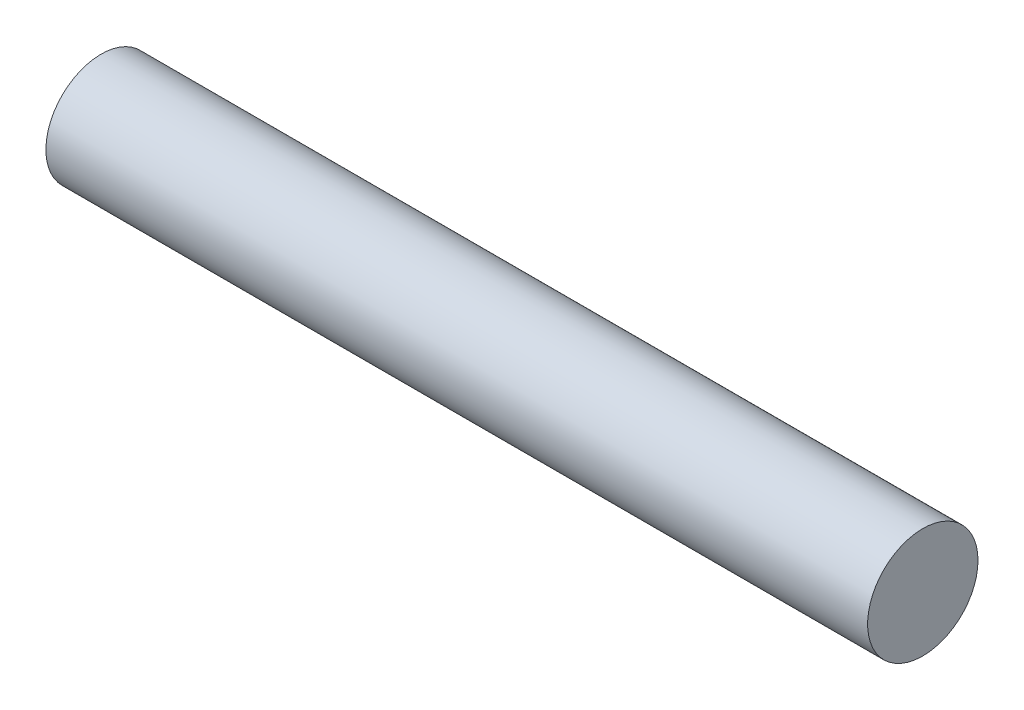
ISO-10303-21;
HEADER;
FILE_DESCRIPTION(('STEP AP214'),'2;1');
FILE_NAME('part.step','',(''),(''),'','','');
FILE_SCHEMA(('AUTOMOTIVE_DESIGN { 1 0 10303 214 1 1 1 1 }'));
ENDSEC;
DATA;
#1=APPLICATION_CONTEXT('core data for automotive mechanical design processes');
#2=APPLICATION_PROTOCOL_DEFINITION('international standard','automotive_design',2000,#1);
#3=PRODUCT_CONTEXT('',#1,'mechanical');
#4=PRODUCT('Part','Part','',(#3));
#5=PRODUCT_RELATED_PRODUCT_CATEGORY('part','',(#4));
#6=PRODUCT_DEFINITION_FORMATION('','',#4);
#7=PRODUCT_DEFINITION_CONTEXT('part definition',#1,'design');
#8=PRODUCT_DEFINITION('design','',#6,#7);
#9=PRODUCT_DEFINITION_SHAPE('','',#8);
#10=(LENGTH_UNIT() NAMED_UNIT(*) SI_UNIT(.MILLI.,.METRE.));
#11=(NAMED_UNIT(*) PLANE_ANGLE_UNIT() SI_UNIT($,.RADIAN.));
#12=(NAMED_UNIT(*) SI_UNIT($,.STERADIAN.) SOLID_ANGLE_UNIT());
#13=UNCERTAINTY_MEASURE_WITH_UNIT(LENGTH_MEASURE(1.E-05),#10,'distance_accuracy_value','');
#14=(GEOMETRIC_REPRESENTATION_CONTEXT(3) GLOBAL_UNCERTAINTY_ASSIGNED_CONTEXT((#13)) GLOBAL_UNIT_ASSIGNED_CONTEXT((#10,
#11,#12)) REPRESENTATION_CONTEXT('',''));
#15=CARTESIAN_POINT('',(0.,0.,0.));
#16=DIRECTION('',(0.,0.,1.));
#17=DIRECTION('',(1.,0.,0.));
#18=AXIS2_PLACEMENT_3D('',#15,#16,#17);
#19=CARTESIAN_POINT('',(65.2355122421383,0.,0.));
#20=DIRECTION('',(-1.,0.,0.));
#21=DIRECTION('',(0.,0.,1.));
#22=AXIS2_PLACEMENT_3D('',#19,#20,#21);
#23=CYLINDRICAL_SURFACE('',#22,6.34999999999999);
#24=CARTESIAN_POINT('',(-45.6875,0.,0.));
#25=DIRECTION('',(1.,0.,0.));
#26=DIRECTION('',(0.,0.,-1.));
#27=AXIS2_PLACEMENT_3D('',#24,#25,#26);
#28=CIRCLE('',#27,6.34999999999999);
#29=CARTESIAN_POINT('',(-45.6875,0.,-6.34999999999999));
#30=VERTEX_POINT('',#29);
#31=EDGE_CURVE('E10',#30,#30,#28,.F.);
#32=ORIENTED_EDGE('',*,*,#31,.F.);
#33=EDGE_LOOP('',(#32));
#34=FACE_BOUND('',#33,.T.);
#35=CARTESIAN_POINT('',(48.8624999999999,0.,0.));
#36=DIRECTION('',(1.,0.,0.));
#37=DIRECTION('',(0.,0.,-1.));
#38=AXIS2_PLACEMENT_3D('',#35,#36,#37);
#39=CIRCLE('',#38,6.35);
#40=CARTESIAN_POINT('',(48.8624999999999,0.,-6.35));
#41=VERTEX_POINT('',#40);
#42=EDGE_CURVE('E42',#41,#41,#39,.T.);
#43=ORIENTED_EDGE('',*,*,#42,.F.);
#44=EDGE_LOOP('',(#43));
#45=FACE_BOUND('',#44,.T.);
#46=ADVANCED_FACE('F35',(#34,#45),#23,.T.);
#47=CARTESIAN_POINT('',(-45.6875,6.35,0.));
#48=DIRECTION('',(1.,0.,0.));
#49=DIRECTION('',(0.,1.,0.));
#50=AXIS2_PLACEMENT_3D('',#47,#48,#49);
#51=PLANE('',#50);
#52=ORIENTED_EDGE('',*,*,#31,.T.);
#53=EDGE_LOOP('',(#52));
#54=FACE_BOUND('',#53,.T.);
#55=ADVANCED_FACE('F54',(#54),#51,.F.);
#56=CARTESIAN_POINT('',(48.8624999999999,0.,0.));
#57=DIRECTION('',(1.,0.,0.));
#58=DIRECTION('',(0.,0.,-1.));
#59=AXIS2_PLACEMENT_3D('',#56,#57,#58);
#60=PLANE('',#59);
#61=ORIENTED_EDGE('',*,*,#42,.T.);
#62=EDGE_LOOP('',(#61));
#63=FACE_BOUND('',#62,.T.);
#64=ADVANCED_FACE('F51',(#63),#60,.T.);
#65=CLOSED_SHELL('',(#46,#55,#64));
#66=MANIFOLD_SOLID_BREP('B2',#65);
#67=ADVANCED_BREP_SHAPE_REPRESENTATION('',(#18,#66),#14);
#68=SHAPE_DEFINITION_REPRESENTATION(#9,#67);
ENDSEC;
END-ISO-10303-21;
